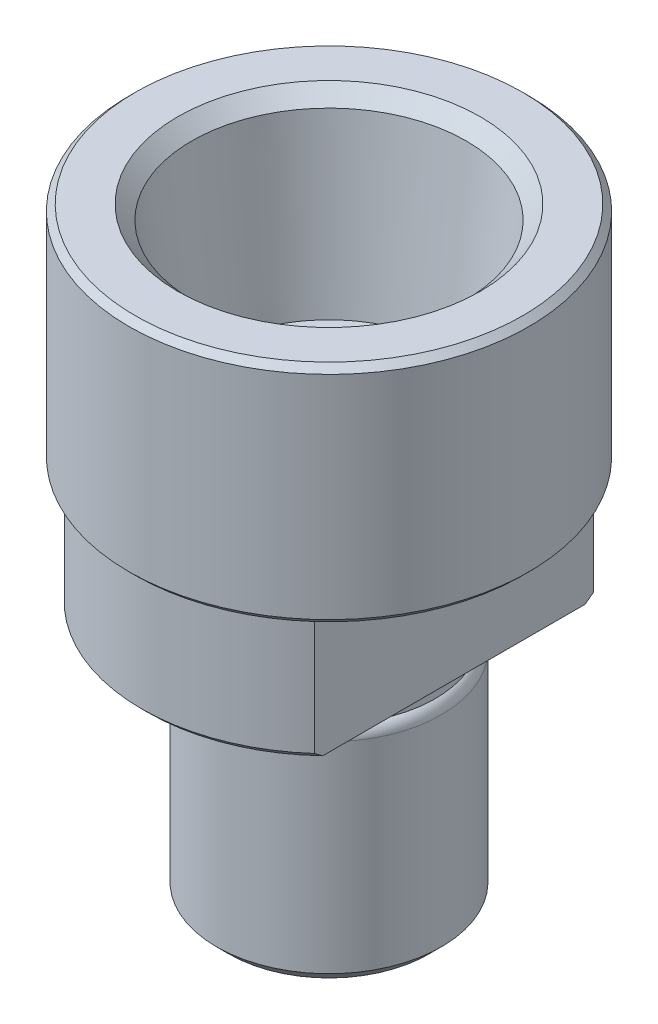
ISO-10303-21;
HEADER;
FILE_DESCRIPTION(('STEP AP214'),'2;1');
FILE_NAME('part.step','',(''),(''),'','','');
FILE_SCHEMA(('AUTOMOTIVE_DESIGN { 1 0 10303 214 1 1 1 1 }'));
ENDSEC;
DATA;
#1=APPLICATION_CONTEXT('core data for automotive mechanical design processes');
#2=APPLICATION_PROTOCOL_DEFINITION('international standard','automotive_design',2000,#1);
#3=PRODUCT_CONTEXT('',#1,'mechanical');
#4=PRODUCT('Part','Part','',(#3));
#5=PRODUCT_RELATED_PRODUCT_CATEGORY('part','',(#4));
#6=PRODUCT_DEFINITION_FORMATION('','',#4);
#7=PRODUCT_DEFINITION_CONTEXT('part definition',#1,'design');
#8=PRODUCT_DEFINITION('design','',#6,#7);
#9=PRODUCT_DEFINITION_SHAPE('','',#8);
#10=(LENGTH_UNIT() NAMED_UNIT(*) SI_UNIT(.MILLI.,.METRE.));
#11=(NAMED_UNIT(*) PLANE_ANGLE_UNIT() SI_UNIT($,.RADIAN.));
#12=(NAMED_UNIT(*) SI_UNIT($,.STERADIAN.) SOLID_ANGLE_UNIT());
#13=UNCERTAINTY_MEASURE_WITH_UNIT(LENGTH_MEASURE(1.E-05),#10,'distance_accuracy_value','');
#14=(GEOMETRIC_REPRESENTATION_CONTEXT(3) GLOBAL_UNCERTAINTY_ASSIGNED_CONTEXT((#13)) GLOBAL_UNIT_ASSIGNED_CONTEXT((#10,
#11,#12)) REPRESENTATION_CONTEXT('',''));
#15=CARTESIAN_POINT('',(0.,0.,0.));
#16=DIRECTION('',(0.,0.,1.));
#17=DIRECTION('',(1.,0.,0.));
#18=AXIS2_PLACEMENT_3D('',#15,#16,#17);
#19=CARTESIAN_POINT('',(0.,50.3749900838748,0.));
#20=DIRECTION('',(0.,1.,0.));
#21=DIRECTION('',(0.,0.,1.));
#22=AXIS2_PLACEMENT_3D('',#19,#20,#21);
#23=CYLINDRICAL_SURFACE('',#22,15.);
#24=CARTESIAN_POINT('',(0.,20.5,0.));
#25=DIRECTION('',(0.,1.,0.));
#26=DIRECTION('',(0.,0.,1.));
#27=AXIS2_PLACEMENT_3D('',#24,#25,#26);
#28=CIRCLE('',#27,15.);
#29=CARTESIAN_POINT('',(10.,20.5,-11.1803398874989));
#30=VERTEX_POINT('',#29);
#31=CARTESIAN_POINT('',(-10.,20.5,-11.180339887499));
#32=VERTEX_POINT('',#31);
#33=EDGE_CURVE('E138',#30,#32,#28,.T.);
#34=ORIENTED_EDGE('',*,*,#33,.T.);
#35=DIRECTION('',(0.,-1.,0.));
#36=VECTOR('',#35,1.);
#37=CARTESIAN_POINT('',(-10.,56.8303043016158,-11.180339887499));
#38=LINE('',#37,#36);
#39=CARTESIAN_POINT('',(-10.,30.,-11.180339887499));
#40=VERTEX_POINT('',#39);
#41=EDGE_CURVE('E103',#40,#32,#38,.T.);
#42=ORIENTED_EDGE('',*,*,#41,.F.);
#43=CARTESIAN_POINT('',(0.,30.,0.));
#44=DIRECTION('',(0.,1.,0.));
#45=DIRECTION('',(0.,0.,1.));
#46=AXIS2_PLACEMENT_3D('',#43,#44,#45);
#47=CIRCLE('',#46,15.);
#48=CARTESIAN_POINT('',(10.,30.,-11.1803398874989));
#49=VERTEX_POINT('',#48);
#50=EDGE_CURVE('E102',#49,#40,#47,.T.);
#51=ORIENTED_EDGE('',*,*,#50,.F.);
#52=DIRECTION('',(0.,-1.,0.));
#53=VECTOR('',#52,1.);
#54=CARTESIAN_POINT('',(10.,56.8303043016158,-11.1803398874989));
#55=LINE('',#54,#53);
#56=EDGE_CURVE('E237',#49,#30,#55,.T.);
#57=ORIENTED_EDGE('',*,*,#56,.T.);
#58=EDGE_LOOP('',(#34,#42,#51,#57));
#59=FACE_BOUND('',#58,.T.);
#60=ADVANCED_FACE('F33',(#59),#23,.T.);
#61=CARTESIAN_POINT('',(0.,20.5,0.));
#62=DIRECTION('',(0.,1.,0.));
#63=DIRECTION('',(0.,0.,1.));
#64=AXIS2_PLACEMENT_3D('',#61,#62,#63);
#65=CONICAL_SURFACE('',#64,15.,0.785398163397455);
#66=CARTESIAN_POINT('',(-10.,32.0551281433155,-24.600301435306));
#67=CARTESIAN_POINT('',(-10.,31.7125825366176,-24.2305251282627));
#68=CARTESIAN_POINT('',(-10.,31.3706152937058,-23.8602117369216));
#69=CARTESIAN_POINT('',(-10.,30.6880244635735,-23.1183439440154));
#70=CARTESIAN_POINT('',(-10.,30.3474008860252,-22.7467895335523));
#71=CARTESIAN_POINT('',(-10.,29.6676149951656,-22.0021968440291));
#72=CARTESIAN_POINT('',(-10.,29.3284530173511,-21.6291582585249));
#73=CARTESIAN_POINT('',(-10.,28.6519042837314,-20.8814753775148));
#74=CARTESIAN_POINT('',(-10.,28.314517524522,-20.5068310850906));
#75=CARTESIAN_POINT('',(-10.,27.6397969930658,-19.7534520087904));
#76=CARTESIAN_POINT('',(-10.,27.3024755708289,-19.3747061581774));
#77=CARTESIAN_POINT('',(-10.,26.6302799304396,-18.6150489730663));
#78=CARTESIAN_POINT('',(-10.,26.2954057068722,-18.2341376433631));
#79=CARTESIAN_POINT('',(-10.,25.6285881564582,-17.4698295553222));
#80=CARTESIAN_POINT('',(-10.,25.2966445134549,-17.0864330730217));
#81=CARTESIAN_POINT('',(-10.,24.6362143675217,-16.3166730796437));
#82=CARTESIAN_POINT('',(-10.,24.3077278486394,-15.9303095822713));
#83=CARTESIAN_POINT('',(-10.,23.7203567904693,-15.2318603853219));
#84=CARTESIAN_POINT('',(-10.,23.460718448468,-14.9204089029439));
#85=CARTESIAN_POINT('',(-10.,22.9445811649794,-14.2949165396743));
#86=CARTESIAN_POINT('',(-10.,22.688082198857,-13.9808756791344));
#87=CARTESIAN_POINT('',(-10.,22.1787306427372,-13.3497118020136));
#88=CARTESIAN_POINT('',(-10.,21.925879019503,-13.0325880042463));
#89=CARTESIAN_POINT('',(-10.,21.4246159759915,-12.3948484857701));
#90=CARTESIAN_POINT('',(-10.,21.1762045227414,-12.0742327910204));
#91=CARTESIAN_POINT('',(-10.,20.6850231705941,-11.4292855575583));
#92=CARTESIAN_POINT('',(-10.,20.4422470846742,-11.1049587404783));
#93=CARTESIAN_POINT('',(-10.,19.9632084030444,-10.451497657607));
#94=CARTESIAN_POINT('',(-10.,19.7269460637678,-10.1223632033265));
#95=CARTESIAN_POINT('',(-10.,19.2625761065489,-9.45858037232643));
#96=CARTESIAN_POINT('',(-10.,19.0344650683668,-9.12393439640381));
#97=CARTESIAN_POINT('',(-10.,18.5883291924416,-8.44800841754875));
#98=CARTESIAN_POINT('',(-10.,18.3703032218911,-8.10672916584614));
#99=CARTESIAN_POINT('',(-10.,17.9530513120646,-7.42621470071589));
#100=CARTESIAN_POINT('',(-10.,17.7534656463456,-7.08720123909764));
#101=CARTESIAN_POINT('',(-10.,17.3695327531667,-6.40053585021944));
#102=CARTESIAN_POINT('',(-10.,17.1851872304576,-6.05288296220158));
#103=CARTESIAN_POINT('',(-10.,16.8361275722981,-5.34803521455838));
#104=CARTESIAN_POINT('',(-10.,16.6714014786213,-4.99084633143795));
#105=CARTESIAN_POINT('',(-10.,16.3669226880794,-4.26592049930803));
#106=CARTESIAN_POINT('',(-10.,16.2271629659364,-3.89818655147801));
#107=CARTESIAN_POINT('',(-10.,16.0062961966899,-3.23383655473614));
#108=CARTESIAN_POINT('',(-10.,15.9190469949303,-2.93927428997702));
#109=CARTESIAN_POINT('',(-10.,15.7670987266254,-2.34434424589865));
#110=CARTESIAN_POINT('',(-10.,15.7023968535694,-2.04397719402864));
#111=CARTESIAN_POINT('',(-10.,15.5987509796947,-1.43978582746658));
#112=CARTESIAN_POINT('',(-10.,15.5597228733951,-1.13597615176324));
#113=CARTESIAN_POINT('',(-10.,15.5092169403613,-0.526054310012815));
#114=CARTESIAN_POINT('',(-10.,15.4977375161985,-0.219942278501946));
#115=CARTESIAN_POINT('',(-10.,15.5030101909215,0.39288615579058));
#116=CARTESIAN_POINT('',(-10.,15.5198408521688,0.699601873355634));
#117=CARTESIAN_POINT('',(-10.,15.580895334157,1.31027256136684));
#118=CARTESIAN_POINT('',(-10.,15.6251213224196,1.6142273114339));
#119=CARTESIAN_POINT('',(-10.,15.7387751184749,2.21830182477042));
#120=CARTESIAN_POINT('',(-10.,15.8082812437306,2.51840663685405));
#121=CARTESIAN_POINT('',(-10.,15.9693044354223,3.11258498741945));
#122=CARTESIAN_POINT('',(-10.,16.0608225127759,3.4066582482237));
#123=CARTESIAN_POINT('',(-10.,16.2738675985422,4.0209897681894));
#124=CARTESIAN_POINT('',(-10.,16.3976122207184,4.3404724644233));
#125=CARTESIAN_POINT('',(-10.,16.6639729580999,4.97153809464004));
#126=CARTESIAN_POINT('',(-10.,16.8065970605809,5.28311761820124));
#127=CARTESIAN_POINT('',(-10.,17.1073003260767,5.89931027808762));
#128=CARTESIAN_POINT('',(-10.,17.2654047268833,6.20391100475452));
#129=CARTESIAN_POINT('',(-10.,17.5938952802646,6.80632330667274));
#130=CARTESIAN_POINT('',(-10.,17.7642798760128,7.10413573623416));
#131=CARTESIAN_POINT('',(-10.,18.1172143873435,7.69751165277869));
#132=CARTESIAN_POINT('',(-10.,18.2998902472479,7.99299987912242));
#133=CARTESIAN_POINT('',(-10.,18.6735561979172,8.57866027433949));
#134=CARTESIAN_POINT('',(-10.,18.8645464780477,8.86883232191975));
#135=CARTESIAN_POINT('',(-10.,19.2531590846266,9.4442765123453));
#136=CARTESIAN_POINT('',(-10.,19.4507747839012,9.72955314398335));
#137=CARTESIAN_POINT('',(-10.,19.8516439266499,10.2961030217628));
#138=CARTESIAN_POINT('',(-10.,20.0548973114267,10.5773763095392));
#139=CARTESIAN_POINT('',(-10.,20.4906731642579,11.1698361355407));
#140=CARTESIAN_POINT('',(-10.,20.7237921289497,11.4805832642133));
#141=CARTESIAN_POINT('',(-10.,21.1949151858334,12.0983578065296));
#142=CARTESIAN_POINT('',(-10.,21.4329194166082,12.4053851142573));
#143=CARTESIAN_POINT('',(-10.,21.9130269010637,13.0162639901405));
#144=CARTESIAN_POINT('',(-10.,22.1551305680513,13.3201152330289));
#145=CARTESIAN_POINT('',(-10.,22.6427801572906,13.9250452435945));
#146=CARTESIAN_POINT('',(-10.,22.8883261253931,14.2261239742538));
#147=CARTESIAN_POINT('',(-10.,23.6297659430664,15.1262913483686));
#148=CARTESIAN_POINT('',(-10.,24.1300372852146,15.721775003996));
#149=CARTESIAN_POINT('',(-10.,25.1391809164494,16.9054078621086));
#150=CARTESIAN_POINT('',(-10.,25.6480534348401,17.4935568683262));
#151=CARTESIAN_POINT('',(-10.,26.4016610814031,18.3547586054077));
#152=CARTESIAN_POINT('',(-10.,26.6438460286067,18.6300485368081));
#153=CARTESIAN_POINT('',(-10.,27.1295115535875,19.1794756449901));
#154=CARTESIAN_POINT('',(-10.,27.3729921112032,19.4536128395919));
#155=CARTESIAN_POINT('',(-10.,28.1051742796928,20.2744964535645));
#156=CARTESIAN_POINT('',(-10.,28.5956045664848,20.8197014246405));
#157=CARTESIAN_POINT('',(-10.,29.5791901685143,21.9057155793991));
#158=CARTESIAN_POINT('',(-10.,30.0723383375271,22.4465312458109));
#159=CARTESIAN_POINT('',(-10.,31.0616371381099,23.5253677479198));
#160=CARTESIAN_POINT('',(-10.,31.5577876398695,24.0633887026075));
#161=CARTESIAN_POINT('',(-10.,32.0551281433155,24.600301435306));
#162=B_SPLINE_CURVE_WITH_KNOTS('',3,(#66,#67,#68,#69,#70,#71,#72,#73,#74,#75,#76,#77,#78,#79,
#80,#81,#82,#83,#84,#85,#86,#87,#88,#89,#90,#91,#92,#93,#94,#95,#96,#97,#98,#99,#100,#101,#102,
#103,#104,#105,#106,#107,#108,#109,#110,#111,#112,#113,#114,#115,#116,#117,#118,#119,#120,#121,
#122,#123,#124,#125,#126,#127,#128,#129,#130,#131,#132,#133,#134,#135,#136,#137,#138,#139,#140,
#141,#142,#143,#144,#145,#146,#147,#148,#149,#150,#151,#152,#153,#154,#155,#156,#157,#158,#159,
#160,#161),.UNSPECIFIED.,.F.,.F.,(4,2,2,2,2,2,2,2,2,2,2,2,2,2,2,2,2,2,2,2,2,2,2,2,2,2,2,2,2,2,2,
2,2,2,2,2,2,2,2,2,2,2,2,2,2,2,2,4),(0.,1.51216749977916,3.02434586497222,4.5368545927361,
6.04936041893964,7.57089920622191,9.09243462579799,10.6138038426217,12.1351660362424,
13.3515893300816,14.5680030723538,15.7847335218968,17.0014549322401,18.2167704496425,
19.4321337435162,20.6469809422192,21.8616913499434,23.0415875561638,24.2216155665908,
25.4009206177083,26.5798933001031,27.5007795828026,28.421551199982,29.3392912096564,
30.256978002283,31.1772156401907,32.0975260967192,33.0207122897581,33.9439408890079,
34.9710214022372,35.9985378359387,37.027758260183,38.0568484333431,39.0988674623669,
40.1409102363993,41.1819400883153,42.2229591055277,43.3883070381992,44.5536880746974,
45.7191873133388,46.884702090947,49.2177827141038,51.5509256346537,52.6508963009564,
53.7508498998676,55.9508108765637,58.1464973301058,60.3420895186264),.UNSPECIFIED.);
#163=CARTESIAN_POINT('',(-10.,20.,-10.5));
#164=VERTEX_POINT('',#163);
#165=EDGE_CURVE('E240',#32,#164,#162,.T.);
#166=ORIENTED_EDGE('',*,*,#165,.F.);
#167=ORIENTED_EDGE('',*,*,#33,.F.);
#168=CARTESIAN_POINT('',(10.,32.0551281433155,24.600301435306));
#169=CARTESIAN_POINT('',(10.,31.7125825366176,24.2305251282627));
#170=CARTESIAN_POINT('',(10.,31.3706152937058,23.8602117369216));
#171=CARTESIAN_POINT('',(10.,30.6880244635734,23.1183439440154));
#172=CARTESIAN_POINT('',(10.,30.3474008860252,22.7467895335523));
#173=CARTESIAN_POINT('',(10.,29.6676149951655,22.0021968440291));
#174=CARTESIAN_POINT('',(10.,29.3284530173511,21.6291582585249));
#175=CARTESIAN_POINT('',(10.,28.6519042837314,20.8814753775147));
#176=CARTESIAN_POINT('',(10.,28.314517524522,20.5068310850906));
#177=CARTESIAN_POINT('',(10.,27.6397969930658,19.7534520087904));
#178=CARTESIAN_POINT('',(10.,27.3024755708289,19.3747061581774));
#179=CARTESIAN_POINT('',(10.,26.6302799304396,18.6150489730663));
#180=CARTESIAN_POINT('',(10.,26.2954057068721,18.2341376433631));
#181=CARTESIAN_POINT('',(10.,25.6285881564581,17.4698295553221));
#182=CARTESIAN_POINT('',(10.,25.2966445134549,17.0864330730217));
#183=CARTESIAN_POINT('',(10.,24.6362143675217,16.3166730796437));
#184=CARTESIAN_POINT('',(10.,24.3077278486394,15.9303095822713));
#185=CARTESIAN_POINT('',(10.,23.7203567904693,15.2318603853219));
#186=CARTESIAN_POINT('',(10.,23.460718448468,14.9204089029439));
#187=CARTESIAN_POINT('',(10.,22.9445811649794,14.2949165396743));
#188=CARTESIAN_POINT('',(10.,22.688082198857,13.9808756791343));
#189=CARTESIAN_POINT('',(10.,22.1787306427371,13.3497118020136));
#190=CARTESIAN_POINT('',(10.,21.925879019503,13.0325880042463));
#191=CARTESIAN_POINT('',(10.,21.4246159759915,12.3948484857701));
#192=CARTESIAN_POINT('',(10.,21.1762045227413,12.0742327910204));
#193=CARTESIAN_POINT('',(10.,20.6850231705941,11.4292855575583));
#194=CARTESIAN_POINT('',(10.,20.4422470846742,11.1049587404783));
#195=CARTESIAN_POINT('',(10.,19.9632084030443,10.451497657607));
#196=CARTESIAN_POINT('',(10.,19.7269460637677,10.1223632033265));
#197=CARTESIAN_POINT('',(10.,19.2625761065489,9.4585803723264));
#198=CARTESIAN_POINT('',(10.,19.0344650683668,9.12393439640378));
#199=CARTESIAN_POINT('',(10.,18.5883291924415,8.44800841754872));
#200=CARTESIAN_POINT('',(10.,18.3703032218911,8.10672916584611));
#201=CARTESIAN_POINT('',(10.,17.9530513120646,7.42621470071586));
#202=CARTESIAN_POINT('',(10.,17.7534656463455,7.08720123909761));
#203=CARTESIAN_POINT('',(10.,17.3695327531667,6.40053585021941));
#204=CARTESIAN_POINT('',(10.,17.1851872304576,6.05288296220156));
#205=CARTESIAN_POINT('',(10.,16.8361275722981,5.34803521455836));
#206=CARTESIAN_POINT('',(10.,16.6714014786213,4.99084633143793));
#207=CARTESIAN_POINT('',(10.,16.3669226880794,4.265920499308));
#208=CARTESIAN_POINT('',(10.,16.2271629659364,3.89818655147799));
#209=CARTESIAN_POINT('',(10.,16.0062961966899,3.23383655473611));
#210=CARTESIAN_POINT('',(10.,15.9190469949303,2.939274289977));
#211=CARTESIAN_POINT('',(10.,15.7670987266254,2.34434424589863));
#212=CARTESIAN_POINT('',(10.,15.7023968535694,2.04397719402862));
#213=CARTESIAN_POINT('',(10.,15.5987509796947,1.43978582746656));
#214=CARTESIAN_POINT('',(10.,15.5597228733951,1.13597615176322));
#215=CARTESIAN_POINT('',(10.,15.5092169403613,0.526054310012792));
#216=CARTESIAN_POINT('',(10.,15.4977375161985,0.219942278501923));
#217=CARTESIAN_POINT('',(10.,15.5030101909215,-0.392886155790602));
#218=CARTESIAN_POINT('',(10.,15.5198408521688,-0.699601873355655));
#219=CARTESIAN_POINT('',(10.,15.580895334157,-1.31027256136686));
#220=CARTESIAN_POINT('',(10.,15.6251213224196,-1.61422731143392));
#221=CARTESIAN_POINT('',(10.,15.7387751184749,-2.21830182477044));
#222=CARTESIAN_POINT('',(10.,15.8082812437306,-2.51840663685407));
#223=CARTESIAN_POINT('',(10.,15.9693044354223,-3.11258498741947));
#224=CARTESIAN_POINT('',(10.,16.0608225127759,-3.40665824822372));
#225=CARTESIAN_POINT('',(10.,16.2738675985422,-4.02098976818942));
#226=CARTESIAN_POINT('',(10.,16.3976122207185,-4.34047246442333));
#227=CARTESIAN_POINT('',(10.,16.6639729580999,-4.97153809464007));
#228=CARTESIAN_POINT('',(10.,16.8065970605809,-5.28311761820127));
#229=CARTESIAN_POINT('',(10.,17.1073003260767,-5.89931027808765));
#230=CARTESIAN_POINT('',(10.,17.2654047268833,-6.20391100475455));
#231=CARTESIAN_POINT('',(10.,17.5938952802647,-6.80632330667277));
#232=CARTESIAN_POINT('',(10.,17.7642798760129,-7.10413573623419));
#233=CARTESIAN_POINT('',(10.,18.1172143873435,-7.69751165277873));
#234=CARTESIAN_POINT('',(10.,18.2998902472479,-7.99299987912245));
#235=CARTESIAN_POINT('',(10.,18.6735561979172,-8.57866027433953));
#236=CARTESIAN_POINT('',(10.,18.8645464780478,-8.86883232191979));
#237=CARTESIAN_POINT('',(10.,19.2531590846266,-9.44427651234535));
#238=CARTESIAN_POINT('',(10.,19.4507747839013,-9.7295531439834));
#239=CARTESIAN_POINT('',(10.,19.85164392665,-10.2961030217628));
#240=CARTESIAN_POINT('',(10.,20.0548973114268,-10.5773763095393));
#241=CARTESIAN_POINT('',(10.,20.4906731642579,-11.1698361355408));
#242=CARTESIAN_POINT('',(10.,20.7237921289497,-11.4805832642134));
#243=CARTESIAN_POINT('',(10.,21.1949151858335,-12.0983578065297));
#244=CARTESIAN_POINT('',(10.,21.4329194166082,-12.4053851142573));
#245=CARTESIAN_POINT('',(10.,21.9130269010638,-13.0162639901405));
#246=CARTESIAN_POINT('',(10.,22.1551305680513,-13.320115233029));
#247=CARTESIAN_POINT('',(10.,22.6427801572907,-13.9250452435945));
#248=CARTESIAN_POINT('',(10.,22.8883261253931,-14.2261239742538));
#249=CARTESIAN_POINT('',(10.,23.6297659430665,-15.1262913483686));
#250=CARTESIAN_POINT('',(10.,24.1300372852146,-15.7217750039961));
#251=CARTESIAN_POINT('',(10.,25.1391809164495,-16.9054078621086));
#252=CARTESIAN_POINT('',(10.,25.6480534348401,-17.4935568683262));
#253=CARTESIAN_POINT('',(10.,26.4016610814031,-18.3547586054077));
#254=CARTESIAN_POINT('',(10.,26.6438460286067,-18.6300485368081));
#255=CARTESIAN_POINT('',(10.,27.1295115535875,-19.1794756449901));
#256=CARTESIAN_POINT('',(10.,27.3729921112032,-19.4536128395919));
#257=CARTESIAN_POINT('',(10.,28.1051742796928,-20.2744964535645));
#258=CARTESIAN_POINT('',(10.,28.5956045664848,-20.8197014246405));
#259=CARTESIAN_POINT('',(10.,29.5791901685143,-21.9057155793991));
#260=CARTESIAN_POINT('',(10.,30.0723383375271,-22.4465312458109));
#261=CARTESIAN_POINT('',(10.,31.0616371381099,-23.5253677479198));
#262=CARTESIAN_POINT('',(10.,31.5577876398695,-24.0633887026075));
#263=CARTESIAN_POINT('',(10.,32.0551281433155,-24.600301435306));
#264=B_SPLINE_CURVE_WITH_KNOTS('',3,(#168,#169,#170,#171,#172,#173,#174,#175,#176,#177,#178,
#179,#180,#181,#182,#183,#184,#185,#186,#187,#188,#189,#190,#191,#192,#193,#194,#195,#196,#197,
#198,#199,#200,#201,#202,#203,#204,#205,#206,#207,#208,#209,#210,#211,#212,#213,#214,#215,#216,
#217,#218,#219,#220,#221,#222,#223,#224,#225,#226,#227,#228,#229,#230,#231,#232,#233,#234,#235,
#236,#237,#238,#239,#240,#241,#242,#243,#244,#245,#246,#247,#248,#249,#250,#251,#252,#253,#254,
#255,#256,#257,#258,#259,#260,#261,#262,#263),.UNSPECIFIED.,.F.,.F.,(4,2,2,2,2,2,2,2,2,2,2,2,2,
2,2,2,2,2,2,2,2,2,2,2,2,2,2,2,2,2,2,2,2,2,2,2,2,2,2,2,2,2,2,2,2,2,2,4),(0.,1.51216749977916,
3.02434586497222,4.5368545927361,6.04936041893964,7.57089920622191,9.09243462579799,
10.6138038426217,12.1351660362424,13.3515893300816,14.5680030723538,15.7847335218968,
17.0014549322401,18.2167704496425,19.4321337435162,20.6469809422192,21.8616913499434,
23.0415875561638,24.2216155665908,25.4009206177083,26.5798933001031,27.5007795828026,
28.421551199982,29.3392912096565,30.256978002283,31.1772156401907,32.0975260967192,
33.0207122897581,33.9439408890079,34.9710214022372,35.9985378359387,37.027758260183,
38.0568484333431,39.098867462367,40.1409102363993,41.1819400883154,42.2229591055277,
43.3883070381992,44.5536880746975,45.7191873133388,46.884702090947,49.2177827141038,
51.5509256346537,52.6508963009564,53.7508498998676,55.9508108765637,58.1464973301058,
60.3420895186263),.UNSPECIFIED.);
#265=CARTESIAN_POINT('',(10.,20.,-10.5));
#266=VERTEX_POINT('',#265);
#267=EDGE_CURVE('E144',#266,#30,#264,.T.);
#268=ORIENTED_EDGE('',*,*,#267,.F.);
#269=CARTESIAN_POINT('',(0.,20.,0.));
#270=DIRECTION('',(0.,1.,0.));
#271=DIRECTION('',(0.,0.,1.));
#272=AXIS2_PLACEMENT_3D('',#269,#270,#271);
#273=CIRCLE('',#272,14.5);
#274=EDGE_CURVE('E55',#164,#266,#273,.F.);
#275=ORIENTED_EDGE('',*,*,#274,.F.);
#276=EDGE_LOOP('',(#166,#167,#268,#275));
#277=FACE_BOUND('',#276,.T.);
#278=ADVANCED_FACE('F208',(#277),#65,.T.);
#279=CARTESIAN_POINT('',(0.,48.,0.));
#280=DIRECTION('',(0.,1.,0.));
#281=DIRECTION('',(0.,0.,1.));
#282=AXIS2_PLACEMENT_3D('',#279,#280,#281);
#283=CONICAL_SURFACE('',#282,11.11,0.106983463741505);
#284=CARTESIAN_POINT('',(0.,46.8796855060239,0.));
#285=DIRECTION('',(0.,-1.,0.));
#286=DIRECTION('',(0.,0.,-1.));
#287=AXIS2_PLACEMENT_3D('',#284,#285,#286);
#288=CIRCLE('',#287,10.9896855060238);
#289=CARTESIAN_POINT('',(0.,46.8796855060239,-10.9896855060238));
#290=VERTEX_POINT('',#289);
#291=EDGE_CURVE('E41',#290,#290,#288,.F.);
#292=ORIENTED_EDGE('',*,*,#291,.T.);
#293=EDGE_LOOP('',(#292));
#294=FACE_BOUND('',#293,.T.);
#295=CARTESIAN_POINT('',(0.,33.2411923595496,0.));
#296=DIRECTION('',(0.,1.,0.));
#297=DIRECTION('',(0.,0.,1.));
#298=AXIS2_PLACEMENT_3D('',#295,#296,#297);
#299=CIRCLE('',#298,9.525);
#300=CARTESIAN_POINT('',(0.,33.2411923595496,9.525));
#301=VERTEX_POINT('',#300);
#302=EDGE_CURVE('E246',#301,#301,#299,.T.);
#303=ORIENTED_EDGE('',*,*,#302,.F.);
#304=EDGE_LOOP('',(#303));
#305=FACE_BOUND('',#304,.T.);
#306=ADVANCED_FACE('F204',(#294,#305),#283,.F.);
#307=CARTESIAN_POINT('',(11.11,48.,0.));
#308=DIRECTION('',(0.,-1.,0.));
#309=DIRECTION('',(0.,0.,-1.));
#310=AXIS2_PLACEMENT_3D('',#307,#308,#309);
#311=PLANE('',#310);
#312=CARTESIAN_POINT('',(0.,48.,0.));
#313=DIRECTION('',(0.,-1.,0.));
#314=DIRECTION('',(0.,0.,-1.));
#315=AXIS2_PLACEMENT_3D('',#312,#313,#314);
#316=CIRCLE('',#315,12.11);
#317=CARTESIAN_POINT('',(0.,48.,-12.11));
#318=VERTEX_POINT('',#317);
#319=EDGE_CURVE('E11',#318,#318,#316,.T.);
#320=ORIENTED_EDGE('',*,*,#319,.T.);
#321=EDGE_LOOP('',(#320));
#322=FACE_BOUND('',#321,.T.);
#323=CARTESIAN_POINT('',(0.,48.,0.));
#324=DIRECTION('',(0.,-1.,0.));
#325=DIRECTION('',(0.,0.,-1.));
#326=AXIS2_PLACEMENT_3D('',#323,#324,#325);
#327=CIRCLE('',#326,15.5);
#328=CARTESIAN_POINT('',(0.,48.,-15.5));
#329=VERTEX_POINT('',#328);
#330=EDGE_CURVE('E125',#329,#329,#327,.F.);
#331=ORIENTED_EDGE('',*,*,#330,.T.);
#332=EDGE_LOOP('',(#331));
#333=FACE_BOUND('',#332,.T.);
#334=ADVANCED_FACE('F200',(#322,#333),#311,.F.);
#335=CARTESIAN_POINT('',(0.,50.3749900838748,0.));
#336=DIRECTION('',(0.,1.,0.));
#337=DIRECTION('',(0.,0.,1.));
#338=AXIS2_PLACEMENT_3D('',#335,#336,#337);
#339=CYLINDRICAL_SURFACE('',#338,16.);
#340=CARTESIAN_POINT('',(0.,47.5,0.));
#341=DIRECTION('',(0.,-1.,0.));
#342=DIRECTION('',(0.,0.,-1.));
#343=AXIS2_PLACEMENT_3D('',#340,#341,#342);
#344=CIRCLE('',#343,16.);
#345=CARTESIAN_POINT('',(0.,47.5,-16.));
#346=VERTEX_POINT('',#345);
#347=EDGE_CURVE('E131',#346,#346,#344,.T.);
#348=ORIENTED_EDGE('',*,*,#347,.T.);
#349=EDGE_LOOP('',(#348));
#350=FACE_BOUND('',#349,.T.);
#351=CARTESIAN_POINT('',(0.,30.5,0.));
#352=DIRECTION('',(0.,1.,0.));
#353=DIRECTION('',(0.,0.,1.));
#354=AXIS2_PLACEMENT_3D('',#351,#352,#353);
#355=CIRCLE('',#354,16.);
#356=CARTESIAN_POINT('',(0.,30.5,16.));
#357=VERTEX_POINT('',#356);
#358=EDGE_CURVE('E128',#357,#357,#355,.T.);
#359=ORIENTED_EDGE('',*,*,#358,.T.);
#360=EDGE_LOOP('',(#359));
#361=FACE_BOUND('',#360,.T.);
#362=ADVANCED_FACE('F196',(#350,#361),#339,.T.);
#363=CARTESIAN_POINT('',(16.,30.,0.));
#364=DIRECTION('',(0.,1.,0.));
#365=DIRECTION('',(0.,0.,1.));
#366=AXIS2_PLACEMENT_3D('',#363,#364,#365);
#367=PLANE('',#366);
#368=CARTESIAN_POINT('',(0.,30.,0.));
#369=DIRECTION('',(0.,1.,0.));
#370=DIRECTION('',(0.,0.,1.));
#371=AXIS2_PLACEMENT_3D('',#368,#369,#370);
#372=CIRCLE('',#371,15.5);
#373=CARTESIAN_POINT('',(0.,30.,15.5));
#374=VERTEX_POINT('',#373);
#375=EDGE_CURVE('E134',#374,#374,#372,.F.);
#376=ORIENTED_EDGE('',*,*,#375,.T.);
#377=EDGE_LOOP('',(#376));
#378=FACE_BOUND('',#377,.T.);
#379=ORIENTED_EDGE('',*,*,#50,.T.);
#380=DIRECTION('',(0.,0.,1.));
#381=VECTOR('',#380,1.);
#382=CARTESIAN_POINT('',(-10.,30.,11.180339887499));
#383=LINE('',#382,#381);
#384=CARTESIAN_POINT('',(-10.,30.,11.180339887499));
#385=VERTEX_POINT('',#384);
#386=EDGE_CURVE('E88',#40,#385,#383,.T.);
#387=ORIENTED_EDGE('',*,*,#386,.T.);
#388=CARTESIAN_POINT('',(10.,30.,11.1803398874989));
#389=VERTEX_POINT('',#388);
#390=EDGE_CURVE('E99',#385,#389,#47,.T.);
#391=ORIENTED_EDGE('',*,*,#390,.T.);
#392=DIRECTION('',(0.,0.,-1.));
#393=VECTOR('',#392,1.);
#394=CARTESIAN_POINT('',(10.,30.,11.1803398874989));
#395=LINE('',#394,#393);
#396=EDGE_CURVE('E275',#389,#49,#395,.T.);
#397=ORIENTED_EDGE('',*,*,#396,.T.);
#398=EDGE_LOOP('',(#379,#387,#391,#397));
#399=FACE_BOUND('',#398,.T.);
#400=ADVANCED_FACE('F97',(#378,#399),#367,.F.);
#401=ORIENTED_EDGE('',*,*,#390,.F.);
#402=DIRECTION('',(0.,-1.,0.));
#403=VECTOR('',#402,1.);
#404=CARTESIAN_POINT('',(-10.,56.8303043016158,11.180339887499));
#405=LINE('',#404,#403);
#406=CARTESIAN_POINT('',(-10.,20.5,11.180339887499));
#407=VERTEX_POINT('',#406);
#408=EDGE_CURVE('E85',#385,#407,#405,.T.);
#409=ORIENTED_EDGE('',*,*,#408,.T.);
#410=CARTESIAN_POINT('',(10.,20.5,11.1803398874989));
#411=VERTEX_POINT('',#410);
#412=EDGE_CURVE('E137',#407,#411,#28,.T.);
#413=ORIENTED_EDGE('',*,*,#412,.T.);
#414=DIRECTION('',(0.,-1.,0.));
#415=VECTOR('',#414,1.);
#416=CARTESIAN_POINT('',(10.,56.8303043016158,11.1803398874989));
#417=LINE('',#416,#415);
#418=EDGE_CURVE('E108',#389,#411,#417,.T.);
#419=ORIENTED_EDGE('',*,*,#418,.F.);
#420=EDGE_LOOP('',(#401,#409,#413,#419));
#421=FACE_BOUND('',#420,.T.);
#422=ADVANCED_FACE('F106',(#421),#23,.T.);
#423=CARTESIAN_POINT('',(15.,20.,0.));
#424=DIRECTION('',(0.,1.,0.));
#425=DIRECTION('',(0.,0.,1.));
#426=AXIS2_PLACEMENT_3D('',#423,#424,#425);
#427=PLANE('',#426);
#428=CARTESIAN_POINT('',(10.,20.,10.5));
#429=VERTEX_POINT('',#428);
#430=CARTESIAN_POINT('',(-10.,20.,10.5));
#431=VERTEX_POINT('',#430);
#432=EDGE_CURVE('E141',#429,#431,#273,.F.);
#433=ORIENTED_EDGE('',*,*,#432,.T.);
#434=DIRECTION('',(0.,0.,-1.));
#435=VECTOR('',#434,1.);
#436=CARTESIAN_POINT('',(-10.,20.,0.));
#437=LINE('',#436,#435);
#438=EDGE_CURVE('E48',#431,#164,#437,.T.);
#439=ORIENTED_EDGE('',*,*,#438,.T.);
#440=ORIENTED_EDGE('',*,*,#274,.T.);
#441=DIRECTION('',(0.,0.,1.));
#442=VECTOR('',#441,1.);
#443=CARTESIAN_POINT('',(10.,20.,0.));
#444=LINE('',#443,#442);
#445=EDGE_CURVE('E243',#266,#429,#444,.T.);
#446=ORIENTED_EDGE('',*,*,#445,.T.);
#447=EDGE_LOOP('',(#433,#439,#440,#446));
#448=FACE_BOUND('',#447,.T.);
#449=CARTESIAN_POINT('',(0.,20.,0.));
#450=DIRECTION('',(0.,1.,0.));
#451=DIRECTION('',(0.,0.,1.));
#452=AXIS2_PLACEMENT_3D('',#449,#450,#451);
#453=CIRCLE('',#452,8.5);
#454=CARTESIAN_POINT('',(0.,20.,8.5));
#455=VERTEX_POINT('',#454);
#456=EDGE_CURVE('E109',#455,#455,#453,.T.);
#457=ORIENTED_EDGE('',*,*,#456,.T.);
#458=EDGE_LOOP('',(#457));
#459=FACE_BOUND('',#458,.T.);
#460=ADVANCED_FACE('F188',(#448,#459),#427,.F.);
#461=CARTESIAN_POINT('',(0.,50.3749900838748,0.));
#462=DIRECTION('',(0.,1.,0.));
#463=DIRECTION('',(0.,0.,1.));
#464=AXIS2_PLACEMENT_3D('',#461,#462,#463);
#465=CYLINDRICAL_SURFACE('',#464,8.5);
#466=ORIENTED_EDGE('',*,*,#456,.F.);
#467=EDGE_LOOP('',(#466));
#468=FACE_BOUND('',#467,.T.);
#469=CARTESIAN_POINT('',(0.,17.9516889657543,0.));
#470=DIRECTION('',(0.,1.,0.));
#471=DIRECTION('',(0.,0.,1.));
#472=AXIS2_PLACEMENT_3D('',#469,#470,#471);
#473=CIRCLE('',#472,8.5);
#474=CARTESIAN_POINT('',(0.,17.9516889657543,8.5));
#475=VERTEX_POINT('',#474);
#476=EDGE_CURVE('E113',#475,#475,#473,.T.);
#477=ORIENTED_EDGE('',*,*,#476,.T.);
#478=EDGE_LOOP('',(#477));
#479=FACE_BOUND('',#478,.T.);
#480=ADVANCED_FACE('F184',(#468,#479),#465,.T.);
#481=CARTESIAN_POINT('',(0.,50.3749900838748,0.));
#482=DIRECTION('',(0.,1.,0.));
#483=DIRECTION('',(0.,0.,1.));
#484=AXIS2_PLACEMENT_3D('',#481,#482,#483);
#485=CYLINDRICAL_SURFACE('',#484,9.00000000000001);
#486=CARTESIAN_POINT('',(0.,17.0856635619699,0.));
#487=DIRECTION('',(0.,1.,0.));
#488=DIRECTION('',(0.,0.,1.));
#489=AXIS2_PLACEMENT_3D('',#486,#487,#488);
#490=CIRCLE('',#489,9.00000000000001);
#491=CARTESIAN_POINT('',(0.,17.0856635619699,9.00000000000001));
#492=VERTEX_POINT('',#491);
#493=EDGE_CURVE('E122',#492,#492,#490,.F.);
#494=ORIENTED_EDGE('',*,*,#493,.T.);
#495=EDGE_LOOP('',(#494));
#496=FACE_BOUND('',#495,.T.);
#497=CARTESIAN_POINT('',(0.,0.999999999999994,0.));
#498=DIRECTION('',(0.,1.,0.));
#499=DIRECTION('',(0.,0.,1.));
#500=AXIS2_PLACEMENT_3D('',#497,#498,#499);
#501=CIRCLE('',#500,9.00000000000001);
#502=CARTESIAN_POINT('',(0.,0.999999999999994,9.00000000000001));
#503=VERTEX_POINT('',#502);
#504=EDGE_CURVE('E111',#503,#503,#501,.T.);
#505=ORIENTED_EDGE('',*,*,#504,.T.);
#506=EDGE_LOOP('',(#505));
#507=FACE_BOUND('',#506,.T.);
#508=ADVANCED_FACE('F180',(#496,#507),#485,.T.);
#509=CARTESIAN_POINT('',(9.00000000000001,0.,0.));
#510=DIRECTION('',(0.,1.,0.));
#511=DIRECTION('',(0.,0.,1.));
#512=AXIS2_PLACEMENT_3D('',#509,#510,#511);
#513=PLANE('',#512);
#514=CARTESIAN_POINT('',(0.,0.,0.));
#515=DIRECTION('',(0.,1.,0.));
#516=DIRECTION('',(0.,0.,1.));
#517=AXIS2_PLACEMENT_3D('',#514,#515,#516);
#518=CIRCLE('',#517,8.00000000000001);
#519=CARTESIAN_POINT('',(0.,0.,8.00000000000001));
#520=VERTEX_POINT('',#519);
#521=EDGE_CURVE('E119',#520,#520,#518,.F.);
#522=ORIENTED_EDGE('',*,*,#521,.T.);
#523=EDGE_LOOP('',(#522));
#524=FACE_BOUND('',#523,.T.);
#525=CARTESIAN_POINT('',(0.,0.,0.));
#526=DIRECTION('',(0.,1.,0.));
#527=DIRECTION('',(0.,0.,1.));
#528=AXIS2_PLACEMENT_3D('',#525,#526,#527);
#529=CIRCLE('',#528,4.76250000000001);
#530=CARTESIAN_POINT('',(0.,0.,4.76250000000001));
#531=VERTEX_POINT('',#530);
#532=EDGE_CURVE('E259',#531,#531,#529,.T.);
#533=ORIENTED_EDGE('',*,*,#532,.T.);
#534=EDGE_LOOP('',(#533));
#535=FACE_BOUND('',#534,.T.);
#536=ADVANCED_FACE('F176',(#524,#535),#513,.F.);
#537=CARTESIAN_POINT('',(0.,50.3749900838748,0.));
#538=DIRECTION('',(0.,1.,0.));
#539=DIRECTION('',(0.,0.,1.));
#540=AXIS2_PLACEMENT_3D('',#537,#538,#539);
#541=CYLINDRICAL_SURFACE('',#540,4.76250000000001);
#542=ORIENTED_EDGE('',*,*,#532,.F.);
#543=EDGE_LOOP('',(#542));
#544=FACE_BOUND('',#543,.T.);
#545=CARTESIAN_POINT('',(0.,32.2411923595496,0.));
#546=DIRECTION('',(0.,1.,0.));
#547=DIRECTION('',(0.,0.,1.));
#548=AXIS2_PLACEMENT_3D('',#545,#546,#547);
#549=CIRCLE('',#548,4.76250000000001);
#550=CARTESIAN_POINT('',(0.,32.2411923595496,4.76250000000001));
#551=VERTEX_POINT('',#550);
#552=EDGE_CURVE('E256',#551,#551,#549,.T.);
#553=ORIENTED_EDGE('',*,*,#552,.T.);
#554=EDGE_LOOP('',(#553));
#555=FACE_BOUND('',#554,.T.);
#556=ADVANCED_FACE('F172',(#544,#555),#541,.F.);
#557=CARTESIAN_POINT('',(0.,33.2411923595496,0.));
#558=DIRECTION('',(0.,1.,0.));
#559=DIRECTION('',(0.,0.,1.));
#560=AXIS2_PLACEMENT_3D('',#557,#558,#559);
#561=CONICAL_SURFACE('',#560,5.76250000000001,0.785398163397448);
#562=ORIENTED_EDGE('',*,*,#552,.F.);
#563=EDGE_LOOP('',(#562));
#564=FACE_BOUND('',#563,.T.);
#565=CARTESIAN_POINT('',(0.,33.2411923595496,0.));
#566=DIRECTION('',(0.,1.,0.));
#567=DIRECTION('',(0.,0.,1.));
#568=AXIS2_PLACEMENT_3D('',#565,#566,#567);
#569=CIRCLE('',#568,5.76250000000001);
#570=CARTESIAN_POINT('',(0.,33.2411923595496,5.76250000000001));
#571=VERTEX_POINT('',#570);
#572=EDGE_CURVE('E249',#571,#571,#569,.T.);
#573=ORIENTED_EDGE('',*,*,#572,.T.);
#574=EDGE_LOOP('',(#573));
#575=FACE_BOUND('',#574,.T.);
#576=ADVANCED_FACE('F168',(#564,#575),#561,.F.);
#577=CARTESIAN_POINT('',(9.525,33.2411923595496,0.));
#578=DIRECTION('',(0.,-1.,0.));
#579=DIRECTION('',(0.,0.,-1.));
#580=AXIS2_PLACEMENT_3D('',#577,#578,#579);
#581=PLANE('',#580);
#582=ORIENTED_EDGE('',*,*,#572,.F.);
#583=EDGE_LOOP('',(#582));
#584=FACE_BOUND('',#583,.T.);
#585=ORIENTED_EDGE('',*,*,#302,.T.);
#586=EDGE_LOOP('',(#585));
#587=FACE_BOUND('',#586,.T.);
#588=ADVANCED_FACE('F164',(#584,#587),#581,.F.);
#589=CARTESIAN_POINT('',(0.,0.999999999999994,0.));
#590=DIRECTION('',(0.,1.,0.));
#591=DIRECTION('',(0.,0.,1.));
#592=AXIS2_PLACEMENT_3D('',#589,#590,#591);
#593=CONICAL_SURFACE('',#592,9.00000000000001,0.78539816339745);
#594=ORIENTED_EDGE('',*,*,#521,.F.);
#595=EDGE_LOOP('',(#594));
#596=FACE_BOUND('',#595,.T.);
#597=ORIENTED_EDGE('',*,*,#504,.F.);
#598=EDGE_LOOP('',(#597));
#599=FACE_BOUND('',#598,.T.);
#600=ADVANCED_FACE('F167',(#596,#599),#593,.T.);
#601=CARTESIAN_POINT('',(0.,17.0856635619699,0.));
#602=DIRECTION('',(0.,1.,0.));
#603=DIRECTION('',(0.,0.,1.));
#604=AXIS2_PLACEMENT_3D('',#601,#602,#603);
#605=TOROIDAL_SURFACE('',#604,8.,1.);
#606=ORIENTED_EDGE('',*,*,#493,.F.);
#607=EDGE_LOOP('',(#606));
#608=FACE_BOUND('',#607,.T.);
#609=ORIENTED_EDGE('',*,*,#476,.F.);
#610=EDGE_LOOP('',(#609));
#611=FACE_BOUND('',#610,.T.);
#612=ADVANCED_FACE('F212',(#608,#611),#605,.T.);
#613=CARTESIAN_POINT('',(0.,48.,0.));
#614=DIRECTION('',(0.,-1.,0.));
#615=DIRECTION('',(0.,0.,-1.));
#616=AXIS2_PLACEMENT_3D('',#613,#614,#615);
#617=CONICAL_SURFACE('',#616,15.5,0.785398163397438);
#618=ORIENTED_EDGE('',*,*,#347,.F.);
#619=EDGE_LOOP('',(#618));
#620=FACE_BOUND('',#619,.T.);
#621=ORIENTED_EDGE('',*,*,#330,.F.);
#622=EDGE_LOOP('',(#621));
#623=FACE_BOUND('',#622,.T.);
#624=ADVANCED_FACE('F216',(#620,#623),#617,.T.);
#625=CARTESIAN_POINT('',(0.,30.5,0.));
#626=DIRECTION('',(0.,1.,0.));
#627=DIRECTION('',(0.,0.,1.));
#628=AXIS2_PLACEMENT_3D('',#625,#626,#627);
#629=CONICAL_SURFACE('',#628,16.,0.785398163397459);
#630=ORIENTED_EDGE('',*,*,#375,.F.);
#631=EDGE_LOOP('',(#630));
#632=FACE_BOUND('',#631,.T.);
#633=ORIENTED_EDGE('',*,*,#358,.F.);
#634=EDGE_LOOP('',(#633));
#635=FACE_BOUND('',#634,.T.);
#636=ADVANCED_FACE('F219',(#632,#635),#629,.T.);
#637=EDGE_CURVE('E90',#431,#407,#162,.T.);
#638=ORIENTED_EDGE('',*,*,#637,.F.);
#639=ORIENTED_EDGE('',*,*,#432,.F.);
#640=EDGE_CURVE('E150',#411,#429,#264,.T.);
#641=ORIENTED_EDGE('',*,*,#640,.F.);
#642=ORIENTED_EDGE('',*,*,#412,.F.);
#643=EDGE_LOOP('',(#638,#639,#641,#642));
#644=FACE_BOUND('',#643,.T.);
#645=ADVANCED_FACE('F155',(#644),#65,.T.);
#646=CARTESIAN_POINT('',(10.,56.8303043016158,11.1803398874989));
#647=DIRECTION('',(-1.,0.,0.));
#648=DIRECTION('',(0.,0.,1.));
#649=AXIS2_PLACEMENT_3D('',#646,#647,#648);
#650=PLANE('',#649);
#651=ORIENTED_EDGE('',*,*,#640,.T.);
#652=ORIENTED_EDGE('',*,*,#445,.F.);
#653=ORIENTED_EDGE('',*,*,#267,.T.);
#654=ORIENTED_EDGE('',*,*,#56,.F.);
#655=ORIENTED_EDGE('',*,*,#396,.F.);
#656=ORIENTED_EDGE('',*,*,#418,.T.);
#657=EDGE_LOOP('',(#651,#652,#653,#654,#655,#656));
#658=FACE_BOUND('',#657,.T.);
#659=ADVANCED_FACE('F158',(#658),#650,.F.);
#660=CARTESIAN_POINT('',(-10.,56.8303043016158,11.180339887499));
#661=DIRECTION('',(1.,0.,0.));
#662=DIRECTION('',(0.,0.,-1.));
#663=AXIS2_PLACEMENT_3D('',#660,#661,#662);
#664=PLANE('',#663);
#665=ORIENTED_EDGE('',*,*,#165,.T.);
#666=ORIENTED_EDGE('',*,*,#438,.F.);
#667=ORIENTED_EDGE('',*,*,#637,.T.);
#668=ORIENTED_EDGE('',*,*,#408,.F.);
#669=ORIENTED_EDGE('',*,*,#386,.F.);
#670=ORIENTED_EDGE('',*,*,#41,.T.);
#671=EDGE_LOOP('',(#665,#666,#667,#668,#669,#670));
#672=FACE_BOUND('',#671,.T.);
#673=ADVANCED_FACE('F87',(#672),#664,.F.);
#674=CARTESIAN_POINT('',(0.,46.8796855060239,0.));
#675=DIRECTION('',(0.,1.,0.));
#676=DIRECTION('',(0.,0.,1.));
#677=AXIS2_PLACEMENT_3D('',#674,#675,#676);
#678=CONICAL_SURFACE('',#677,10.9896855060238,0.785398163397454);
#679=ORIENTED_EDGE('',*,*,#319,.F.);
#680=EDGE_LOOP('',(#679));
#681=FACE_BOUND('',#680,.T.);
#682=ORIENTED_EDGE('',*,*,#291,.F.);
#683=EDGE_LOOP('',(#682));
#684=FACE_BOUND('',#683,.T.);
#685=ADVANCED_FACE('F35',(#681,#684),#678,.F.);
#686=CLOSED_SHELL('',(#60,#278,#306,#334,#362,#400,#422,#460,#480,#508,#536,#556,#576,#588,#600,
#612,#624,#636,#645,#659,#673,#685));
#687=MANIFOLD_SOLID_BREP('B2',#686);
#688=ADVANCED_BREP_SHAPE_REPRESENTATION('',(#18,#687),#14);
#689=SHAPE_DEFINITION_REPRESENTATION(#9,#688);
ENDSEC;
END-ISO-10303-21;
